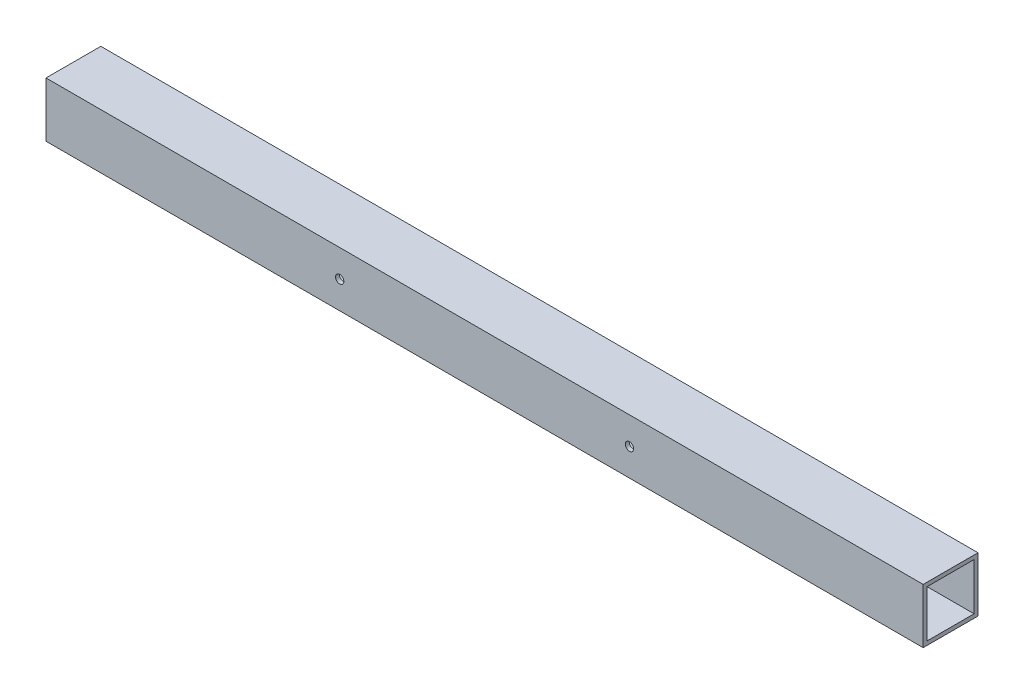
ISO-10303-21;
HEADER;
FILE_DESCRIPTION(('STEP AP214'),'2;1');
FILE_NAME('part.step','',(''),(''),'','','');
FILE_SCHEMA(('AUTOMOTIVE_DESIGN { 1 0 10303 214 1 1 1 1 }'));
ENDSEC;
DATA;
#1=APPLICATION_CONTEXT('core data for automotive mechanical design processes');
#2=APPLICATION_PROTOCOL_DEFINITION('international standard','automotive_design',2000,#1);
#3=PRODUCT_CONTEXT('',#1,'mechanical');
#4=PRODUCT('Part','Part','',(#3));
#5=PRODUCT_RELATED_PRODUCT_CATEGORY('part','',(#4));
#6=PRODUCT_DEFINITION_FORMATION('','',#4);
#7=PRODUCT_DEFINITION_CONTEXT('part definition',#1,'design');
#8=PRODUCT_DEFINITION('design','',#6,#7);
#9=PRODUCT_DEFINITION_SHAPE('','',#8);
#10=(LENGTH_UNIT() NAMED_UNIT(*) SI_UNIT(.MILLI.,.METRE.));
#11=(NAMED_UNIT(*) PLANE_ANGLE_UNIT() SI_UNIT($,.RADIAN.));
#12=(NAMED_UNIT(*) SI_UNIT($,.STERADIAN.) SOLID_ANGLE_UNIT());
#13=UNCERTAINTY_MEASURE_WITH_UNIT(LENGTH_MEASURE(1.E-05),#10,'distance_accuracy_value','');
#14=(GEOMETRIC_REPRESENTATION_CONTEXT(3) GLOBAL_UNCERTAINTY_ASSIGNED_CONTEXT((#13)) GLOBAL_UNIT_ASSIGNED_CONTEXT((#10,
#11,#12)) REPRESENTATION_CONTEXT('',''));
#15=CARTESIAN_POINT('',(0.,0.,0.));
#16=DIRECTION('',(0.,0.,1.));
#17=DIRECTION('',(1.,0.,0.));
#18=AXIS2_PLACEMENT_3D('',#15,#16,#17);
#19=CARTESIAN_POINT('',(-355.6,-22.2249999999999,-22.225));
#20=DIRECTION('',(0.,0.,-1.));
#21=DIRECTION('',(-1.,0.,0.));
#22=AXIS2_PLACEMENT_3D('',#19,#20,#21);
#23=PLANE('',#22);
#24=CARTESIAN_POINT('',(-117.475,0.,-22.225));
#25=DIRECTION('',(0.,0.,1.));
#26=DIRECTION('',(1.,0.,0.));
#27=AXIS2_PLACEMENT_3D('',#24,#25,#26);
#28=CIRCLE('',#27,3.37350099999999);
#29=CARTESIAN_POINT('',(-114.101499,0.,-22.225));
#30=VERTEX_POINT('',#29);
#31=EDGE_CURVE('E226',#30,#30,#28,.T.);
#32=ORIENTED_EDGE('',*,*,#31,.T.);
#33=EDGE_LOOP('',(#32));
#34=FACE_BOUND('',#33,.T.);
#35=CARTESIAN_POINT('',(117.475,0.,-22.225));
#36=DIRECTION('',(0.,0.,1.));
#37=DIRECTION('',(1.,0.,0.));
#38=AXIS2_PLACEMENT_3D('',#35,#36,#37);
#39=CIRCLE('',#38,3.37350099999999);
#40=CARTESIAN_POINT('',(120.848501,0.,-22.225));
#41=VERTEX_POINT('',#40);
#42=EDGE_CURVE('E205',#41,#41,#39,.T.);
#43=ORIENTED_EDGE('',*,*,#42,.T.);
#44=EDGE_LOOP('',(#43));
#45=FACE_BOUND('',#44,.T.);
#46=DIRECTION('',(1.,0.,0.));
#47=VECTOR('',#46,1.);
#48=CARTESIAN_POINT('',(-355.6,22.2249999999999,-22.225));
#49=LINE('',#48,#47);
#50=CARTESIAN_POINT('',(-355.6,22.2249999999999,-22.225));
#51=VERTEX_POINT('',#50);
#52=CARTESIAN_POINT('',(355.6,22.2249999999999,-22.225));
#53=VERTEX_POINT('',#52);
#54=EDGE_CURVE('E194',#51,#53,#49,.T.);
#55=ORIENTED_EDGE('',*,*,#54,.T.);
#56=DIRECTION('',(0.,1.,0.));
#57=VECTOR('',#56,1.);
#58=CARTESIAN_POINT('',(355.6,-22.2249999999999,-22.225));
#59=LINE('',#58,#57);
#60=CARTESIAN_POINT('',(355.6,-22.2249999999999,-22.225));
#61=VERTEX_POINT('',#60);
#62=EDGE_CURVE('E147',#61,#53,#59,.T.);
#63=ORIENTED_EDGE('',*,*,#62,.F.);
#64=DIRECTION('',(1.,0.,0.));
#65=VECTOR('',#64,1.);
#66=CARTESIAN_POINT('',(-355.6,-22.2249999999999,-22.225));
#67=LINE('',#66,#65);
#68=CARTESIAN_POINT('',(-355.6,-22.2249999999999,-22.225));
#69=VERTEX_POINT('',#68);
#70=EDGE_CURVE('E11',#69,#61,#67,.T.);
#71=ORIENTED_EDGE('',*,*,#70,.F.);
#72=DIRECTION('',(0.,1.,0.));
#73=VECTOR('',#72,1.);
#74=CARTESIAN_POINT('',(-355.6,-22.2249999999999,-22.225));
#75=LINE('',#74,#73);
#76=EDGE_CURVE('E175',#69,#51,#75,.T.);
#77=ORIENTED_EDGE('',*,*,#76,.T.);
#78=EDGE_LOOP('',(#55,#63,#71,#77));
#79=FACE_BOUND('',#78,.T.);
#80=ADVANCED_FACE('F43',(#34,#45,#79),#23,.T.);
#81=CARTESIAN_POINT('',(-355.6,-22.2249999999999,22.225));
#82=DIRECTION('',(0.,-1.,0.));
#83=DIRECTION('',(0.,0.,-1.));
#84=AXIS2_PLACEMENT_3D('',#81,#82,#83);
#85=PLANE('',#84);
#86=ORIENTED_EDGE('',*,*,#70,.T.);
#87=DIRECTION('',(0.,0.,-1.));
#88=VECTOR('',#87,1.);
#89=CARTESIAN_POINT('',(355.6,-22.2249999999999,22.225));
#90=LINE('',#89,#88);
#91=CARTESIAN_POINT('',(355.6,-22.2249999999999,22.225));
#92=VERTEX_POINT('',#91);
#93=EDGE_CURVE('E159',#92,#61,#90,.T.);
#94=ORIENTED_EDGE('',*,*,#93,.F.);
#95=DIRECTION('',(1.,0.,0.));
#96=VECTOR('',#95,1.);
#97=CARTESIAN_POINT('',(-355.6,-22.2249999999999,22.225));
#98=LINE('',#97,#96);
#99=CARTESIAN_POINT('',(-355.6,-22.2249999999999,22.225));
#100=VERTEX_POINT('',#99);
#101=EDGE_CURVE('E52',#100,#92,#98,.T.);
#102=ORIENTED_EDGE('',*,*,#101,.F.);
#103=DIRECTION('',(0.,0.,-1.));
#104=VECTOR('',#103,1.);
#105=CARTESIAN_POINT('',(-355.6,-22.2249999999999,22.225));
#106=LINE('',#105,#104);
#107=EDGE_CURVE('E191',#100,#69,#106,.T.);
#108=ORIENTED_EDGE('',*,*,#107,.T.);
#109=EDGE_LOOP('',(#86,#94,#102,#108));
#110=FACE_BOUND('',#109,.T.);
#111=ADVANCED_FACE('F243',(#110),#85,.T.);
#112=CARTESIAN_POINT('',(-355.6,-22.2249999999999,22.225));
#113=DIRECTION('',(0.,0.,1.));
#114=DIRECTION('',(1.,0.,0.));
#115=AXIS2_PLACEMENT_3D('',#112,#113,#114);
#116=PLANE('',#115);
#117=CARTESIAN_POINT('',(-117.475,0.,22.225));
#118=DIRECTION('',(0.,0.,1.));
#119=DIRECTION('',(1.,0.,0.));
#120=AXIS2_PLACEMENT_3D('',#117,#118,#119);
#121=CIRCLE('',#120,3.373501);
#122=CARTESIAN_POINT('',(-114.101499,0.,22.225));
#123=VERTEX_POINT('',#122);
#124=EDGE_CURVE('E230',#123,#123,#121,.T.);
#125=ORIENTED_EDGE('',*,*,#124,.F.);
#126=EDGE_LOOP('',(#125));
#127=FACE_BOUND('',#126,.T.);
#128=CARTESIAN_POINT('',(117.475,0.,22.225));
#129=DIRECTION('',(0.,0.,1.));
#130=DIRECTION('',(1.,0.,0.));
#131=AXIS2_PLACEMENT_3D('',#128,#129,#130);
#132=CIRCLE('',#131,3.373501);
#133=CARTESIAN_POINT('',(120.848501,0.,22.225));
#134=VERTEX_POINT('',#133);
#135=EDGE_CURVE('E213',#134,#134,#132,.T.);
#136=ORIENTED_EDGE('',*,*,#135,.F.);
#137=EDGE_LOOP('',(#136));
#138=FACE_BOUND('',#137,.T.);
#139=ORIENTED_EDGE('',*,*,#101,.T.);
#140=DIRECTION('',(0.,-1.,0.));
#141=VECTOR('',#140,1.);
#142=CARTESIAN_POINT('',(355.6,-22.2249999999999,22.225));
#143=LINE('',#142,#141);
#144=CARTESIAN_POINT('',(355.6,22.2249999999999,22.225));
#145=VERTEX_POINT('',#144);
#146=EDGE_CURVE('E155',#145,#92,#143,.T.);
#147=ORIENTED_EDGE('',*,*,#146,.F.);
#148=DIRECTION('',(1.,0.,0.));
#149=VECTOR('',#148,1.);
#150=CARTESIAN_POINT('',(-355.6,22.2249999999999,22.225));
#151=LINE('',#150,#149);
#152=CARTESIAN_POINT('',(-355.6,22.2249999999999,22.225));
#153=VERTEX_POINT('',#152);
#154=EDGE_CURVE('E198',#153,#145,#151,.T.);
#155=ORIENTED_EDGE('',*,*,#154,.F.);
#156=DIRECTION('',(0.,-1.,0.));
#157=VECTOR('',#156,1.);
#158=CARTESIAN_POINT('',(-355.6,-22.2249999999999,22.225));
#159=LINE('',#158,#157);
#160=EDGE_CURVE('E187',#153,#100,#159,.T.);
#161=ORIENTED_EDGE('',*,*,#160,.T.);
#162=EDGE_LOOP('',(#139,#147,#155,#161));
#163=FACE_BOUND('',#162,.T.);
#164=ADVANCED_FACE('F239',(#127,#138,#163),#116,.T.);
#165=CARTESIAN_POINT('',(-355.6,22.2249999999999,22.225));
#166=DIRECTION('',(0.,1.,0.));
#167=DIRECTION('',(0.,0.,1.));
#168=AXIS2_PLACEMENT_3D('',#165,#166,#167);
#169=PLANE('',#168);
#170=ORIENTED_EDGE('',*,*,#154,.T.);
#171=DIRECTION('',(0.,0.,1.));
#172=VECTOR('',#171,1.);
#173=CARTESIAN_POINT('',(355.6,22.2249999999999,22.225));
#174=LINE('',#173,#172);
#175=EDGE_CURVE('E151',#53,#145,#174,.T.);
#176=ORIENTED_EDGE('',*,*,#175,.F.);
#177=ORIENTED_EDGE('',*,*,#54,.F.);
#178=DIRECTION('',(0.,0.,1.));
#179=VECTOR('',#178,1.);
#180=CARTESIAN_POINT('',(-355.6,22.2249999999999,22.225));
#181=LINE('',#180,#179);
#182=EDGE_CURVE('E183',#51,#153,#181,.T.);
#183=ORIENTED_EDGE('',*,*,#182,.T.);
#184=EDGE_LOOP('',(#170,#176,#177,#183));
#185=FACE_BOUND('',#184,.T.);
#186=ADVANCED_FACE('F242',(#185),#169,.T.);
#187=CARTESIAN_POINT('',(-355.6,0.,0.));
#188=DIRECTION('',(-1.,0.,0.));
#189=DIRECTION('',(0.,0.,1.));
#190=AXIS2_PLACEMENT_3D('',#187,#188,#189);
#191=PLANE('',#190);
#192=DIRECTION('',(0.,1.,0.));
#193=VECTOR('',#192,1.);
#194=CARTESIAN_POINT('',(-355.6,-19.05,-19.05));
#195=LINE('',#194,#193);
#196=CARTESIAN_POINT('',(-355.6,-19.05,-19.05));
#197=VERTEX_POINT('',#196);
#198=CARTESIAN_POINT('',(-355.6,19.05,-19.05));
#199=VERTEX_POINT('',#198);
#200=EDGE_CURVE('E163',#197,#199,#195,.T.);
#201=ORIENTED_EDGE('',*,*,#200,.T.);
#202=DIRECTION('',(0.,0.,1.));
#203=VECTOR('',#202,1.);
#204=CARTESIAN_POINT('',(-355.6,19.05,19.05));
#205=LINE('',#204,#203);
#206=CARTESIAN_POINT('',(-355.6,19.05,19.05));
#207=VERTEX_POINT('',#206);
#208=EDGE_CURVE('E116',#199,#207,#205,.T.);
#209=ORIENTED_EDGE('',*,*,#208,.T.);
#210=DIRECTION('',(0.,-1.,0.));
#211=VECTOR('',#210,1.);
#212=CARTESIAN_POINT('',(-355.6,-19.05,19.05));
#213=LINE('',#212,#211);
#214=CARTESIAN_POINT('',(-355.6,-19.05,19.05));
#215=VERTEX_POINT('',#214);
#216=EDGE_CURVE('E60',#207,#215,#213,.T.);
#217=ORIENTED_EDGE('',*,*,#216,.T.);
#218=DIRECTION('',(0.,0.,-1.));
#219=VECTOR('',#218,1.);
#220=CARTESIAN_POINT('',(-355.6,-19.05,19.05));
#221=LINE('',#220,#219);
#222=EDGE_CURVE('E122',#215,#197,#221,.T.);
#223=ORIENTED_EDGE('',*,*,#222,.T.);
#224=EDGE_LOOP('',(#201,#209,#217,#223));
#225=FACE_BOUND('',#224,.T.);
#226=ORIENTED_EDGE('',*,*,#76,.F.);
#227=ORIENTED_EDGE('',*,*,#107,.F.);
#228=ORIENTED_EDGE('',*,*,#160,.F.);
#229=ORIENTED_EDGE('',*,*,#182,.F.);
#230=EDGE_LOOP('',(#226,#227,#228,#229));
#231=FACE_BOUND('',#230,.T.);
#232=ADVANCED_FACE('F255',(#225,#231),#191,.T.);
#233=CARTESIAN_POINT('',(-355.6,-19.05,-19.05));
#234=DIRECTION('',(0.,0.,-1.));
#235=DIRECTION('',(-1.,0.,0.));
#236=AXIS2_PLACEMENT_3D('',#233,#234,#235);
#237=PLANE('',#236);
#238=CARTESIAN_POINT('',(-117.475,0.,-19.05));
#239=DIRECTION('',(0.,0.,-1.));
#240=DIRECTION('',(-1.,0.,0.));
#241=AXIS2_PLACEMENT_3D('',#238,#239,#240);
#242=CIRCLE('',#241,3.37350099999999);
#243=CARTESIAN_POINT('',(-120.848501,0.,-19.05));
#244=VERTEX_POINT('',#243);
#245=EDGE_CURVE('E220',#244,#244,#242,.T.);
#246=ORIENTED_EDGE('',*,*,#245,.T.);
#247=EDGE_LOOP('',(#246));
#248=FACE_BOUND('',#247,.T.);
#249=CARTESIAN_POINT('',(117.475,0.,-19.05));
#250=DIRECTION('',(0.,0.,-1.));
#251=DIRECTION('',(-1.,0.,0.));
#252=AXIS2_PLACEMENT_3D('',#249,#250,#251);
#253=CIRCLE('',#252,3.37350099999999);
#254=CARTESIAN_POINT('',(114.101499,0.,-19.05));
#255=VERTEX_POINT('',#254);
#256=EDGE_CURVE('E202',#255,#255,#253,.T.);
#257=ORIENTED_EDGE('',*,*,#256,.T.);
#258=EDGE_LOOP('',(#257));
#259=FACE_BOUND('',#258,.T.);
#260=DIRECTION('',(1.,0.,0.));
#261=VECTOR('',#260,1.);
#262=CARTESIAN_POINT('',(-355.6,-19.05,-19.05));
#263=LINE('',#262,#261);
#264=CARTESIAN_POINT('',(355.6,-19.05,-19.05));
#265=VERTEX_POINT('',#264);
#266=EDGE_CURVE('E127',#197,#265,#263,.T.);
#267=ORIENTED_EDGE('',*,*,#266,.T.);
#268=DIRECTION('',(0.,1.,0.));
#269=VECTOR('',#268,1.);
#270=CARTESIAN_POINT('',(355.6,-19.05,-19.05));
#271=LINE('',#270,#269);
#272=CARTESIAN_POINT('',(355.6,19.05,-19.05));
#273=VERTEX_POINT('',#272);
#274=EDGE_CURVE('E125',#265,#273,#271,.T.);
#275=ORIENTED_EDGE('',*,*,#274,.T.);
#276=DIRECTION('',(1.,0.,0.));
#277=VECTOR('',#276,1.);
#278=CARTESIAN_POINT('',(-355.6,19.05,-19.05));
#279=LINE('',#278,#277);
#280=EDGE_CURVE('E109',#199,#273,#279,.T.);
#281=ORIENTED_EDGE('',*,*,#280,.F.);
#282=ORIENTED_EDGE('',*,*,#200,.F.);
#283=EDGE_LOOP('',(#267,#275,#281,#282));
#284=FACE_BOUND('',#283,.T.);
#285=ADVANCED_FACE('F126',(#248,#259,#284),#237,.F.);
#286=CARTESIAN_POINT('',(-355.6,-19.05,19.05));
#287=DIRECTION('',(0.,-1.,0.));
#288=DIRECTION('',(0.,0.,-1.));
#289=AXIS2_PLACEMENT_3D('',#286,#287,#288);
#290=PLANE('',#289);
#291=DIRECTION('',(1.,0.,0.));
#292=VECTOR('',#291,1.);
#293=CARTESIAN_POINT('',(-355.6,-19.05,19.05));
#294=LINE('',#293,#292);
#295=CARTESIAN_POINT('',(355.6,-19.05,19.05));
#296=VERTEX_POINT('',#295);
#297=EDGE_CURVE('E176',#215,#296,#294,.T.);
#298=ORIENTED_EDGE('',*,*,#297,.T.);
#299=DIRECTION('',(0.,0.,-1.));
#300=VECTOR('',#299,1.);
#301=CARTESIAN_POINT('',(355.6,-19.05,19.05));
#302=LINE('',#301,#300);
#303=EDGE_CURVE('E141',#296,#265,#302,.T.);
#304=ORIENTED_EDGE('',*,*,#303,.T.);
#305=ORIENTED_EDGE('',*,*,#266,.F.);
#306=ORIENTED_EDGE('',*,*,#222,.F.);
#307=EDGE_LOOP('',(#298,#304,#305,#306));
#308=FACE_BOUND('',#307,.T.);
#309=ADVANCED_FACE('F279',(#308),#290,.F.);
#310=CARTESIAN_POINT('',(-355.6,-19.05,19.05));
#311=DIRECTION('',(0.,0.,1.));
#312=DIRECTION('',(1.,0.,0.));
#313=AXIS2_PLACEMENT_3D('',#310,#311,#312);
#314=PLANE('',#313);
#315=CARTESIAN_POINT('',(-117.475,0.,19.05));
#316=DIRECTION('',(0.,0.,1.));
#317=DIRECTION('',(1.,0.,0.));
#318=AXIS2_PLACEMENT_3D('',#315,#316,#317);
#319=CIRCLE('',#318,3.37350099999999);
#320=CARTESIAN_POINT('',(-114.101499,0.,19.05));
#321=VERTEX_POINT('',#320);
#322=EDGE_CURVE('E46',#321,#321,#319,.T.);
#323=ORIENTED_EDGE('',*,*,#322,.T.);
#324=EDGE_LOOP('',(#323));
#325=FACE_BOUND('',#324,.T.);
#326=CARTESIAN_POINT('',(117.475,0.,19.05));
#327=DIRECTION('',(0.,0.,1.));
#328=DIRECTION('',(1.,0.,0.));
#329=AXIS2_PLACEMENT_3D('',#326,#327,#328);
#330=CIRCLE('',#329,3.37350099999999);
#331=CARTESIAN_POINT('',(120.848501,0.,19.05));
#332=VERTEX_POINT('',#331);
#333=EDGE_CURVE('E132',#332,#332,#330,.T.);
#334=ORIENTED_EDGE('',*,*,#333,.T.);
#335=EDGE_LOOP('',(#334));
#336=FACE_BOUND('',#335,.T.);
#337=DIRECTION('',(1.,0.,0.));
#338=VECTOR('',#337,1.);
#339=CARTESIAN_POINT('',(-355.6,19.05,19.05));
#340=LINE('',#339,#338);
#341=CARTESIAN_POINT('',(355.6,19.05,19.05));
#342=VERTEX_POINT('',#341);
#343=EDGE_CURVE('E121',#207,#342,#340,.T.);
#344=ORIENTED_EDGE('',*,*,#343,.T.);
#345=DIRECTION('',(0.,-1.,0.));
#346=VECTOR('',#345,1.);
#347=CARTESIAN_POINT('',(355.6,-19.05,19.05));
#348=LINE('',#347,#346);
#349=EDGE_CURVE('E136',#342,#296,#348,.T.);
#350=ORIENTED_EDGE('',*,*,#349,.T.);
#351=ORIENTED_EDGE('',*,*,#297,.F.);
#352=ORIENTED_EDGE('',*,*,#216,.F.);
#353=EDGE_LOOP('',(#344,#350,#351,#352));
#354=FACE_BOUND('',#353,.T.);
#355=ADVANCED_FACE('F284',(#325,#336,#354),#314,.F.);
#356=CARTESIAN_POINT('',(-355.6,19.05,19.05));
#357=DIRECTION('',(0.,1.,0.));
#358=DIRECTION('',(0.,0.,1.));
#359=AXIS2_PLACEMENT_3D('',#356,#357,#358);
#360=PLANE('',#359);
#361=ORIENTED_EDGE('',*,*,#280,.T.);
#362=DIRECTION('',(0.,0.,1.));
#363=VECTOR('',#362,1.);
#364=CARTESIAN_POINT('',(355.6,19.05,19.05));
#365=LINE('',#364,#363);
#366=EDGE_CURVE('E113',#273,#342,#365,.T.);
#367=ORIENTED_EDGE('',*,*,#366,.T.);
#368=ORIENTED_EDGE('',*,*,#343,.F.);
#369=ORIENTED_EDGE('',*,*,#208,.F.);
#370=EDGE_LOOP('',(#361,#367,#368,#369));
#371=FACE_BOUND('',#370,.T.);
#372=ADVANCED_FACE('F111',(#371),#360,.F.);
#373=CARTESIAN_POINT('',(355.6,0.,0.));
#374=DIRECTION('',(-1.,0.,0.));
#375=DIRECTION('',(0.,0.,1.));
#376=AXIS2_PLACEMENT_3D('',#373,#374,#375);
#377=PLANE('',#376);
#378=ORIENTED_EDGE('',*,*,#62,.T.);
#379=ORIENTED_EDGE('',*,*,#175,.T.);
#380=ORIENTED_EDGE('',*,*,#146,.T.);
#381=ORIENTED_EDGE('',*,*,#93,.T.);
#382=EDGE_LOOP('',(#378,#379,#380,#381));
#383=FACE_BOUND('',#382,.T.);
#384=ORIENTED_EDGE('',*,*,#274,.F.);
#385=ORIENTED_EDGE('',*,*,#303,.F.);
#386=ORIENTED_EDGE('',*,*,#349,.F.);
#387=ORIENTED_EDGE('',*,*,#366,.F.);
#388=EDGE_LOOP('',(#384,#385,#386,#387));
#389=FACE_BOUND('',#388,.T.);
#390=ADVANCED_FACE('F134',(#383,#389),#377,.F.);
#391=CARTESIAN_POINT('',(117.475,0.,22.225));
#392=DIRECTION('',(0.,0.,1.));
#393=DIRECTION('',(1.,0.,0.));
#394=AXIS2_PLACEMENT_3D('',#391,#392,#393);
#395=CYLINDRICAL_SURFACE('',#394,3.37350099999999);
#396=ORIENTED_EDGE('',*,*,#42,.F.);
#397=EDGE_LOOP('',(#396));
#398=FACE_BOUND('',#397,.T.);
#399=ORIENTED_EDGE('',*,*,#256,.F.);
#400=EDGE_LOOP('',(#399));
#401=FACE_BOUND('',#400,.T.);
#402=ADVANCED_FACE('F295',(#398,#401),#395,.F.);
#403=ORIENTED_EDGE('',*,*,#135,.T.);
#404=EDGE_LOOP('',(#403));
#405=FACE_BOUND('',#404,.T.);
#406=ORIENTED_EDGE('',*,*,#333,.F.);
#407=EDGE_LOOP('',(#406));
#408=FACE_BOUND('',#407,.T.);
#409=ADVANCED_FACE('F296',(#405,#408),#395,.F.);
#410=CARTESIAN_POINT('',(-117.475,0.,22.225));
#411=DIRECTION('',(0.,0.,1.));
#412=DIRECTION('',(1.,0.,0.));
#413=AXIS2_PLACEMENT_3D('',#410,#411,#412);
#414=CYLINDRICAL_SURFACE('',#413,3.37350099999999);
#415=ORIENTED_EDGE('',*,*,#124,.T.);
#416=EDGE_LOOP('',(#415));
#417=FACE_BOUND('',#416,.T.);
#418=ORIENTED_EDGE('',*,*,#322,.F.);
#419=EDGE_LOOP('',(#418));
#420=FACE_BOUND('',#419,.T.);
#421=ADVANCED_FACE('F236',(#417,#420),#414,.F.);
#422=ORIENTED_EDGE('',*,*,#31,.F.);
#423=EDGE_LOOP('',(#422));
#424=FACE_BOUND('',#423,.T.);
#425=ORIENTED_EDGE('',*,*,#245,.F.);
#426=EDGE_LOOP('',(#425));
#427=FACE_BOUND('',#426,.T.);
#428=ADVANCED_FACE('F272',(#424,#427),#414,.F.);
#429=CLOSED_SHELL('',(#80,#111,#164,#186,#232,#285,#309,#355,#372,#390,#402,#409,#421,#428));
#430=MANIFOLD_SOLID_BREP('B2',#429);
#431=ADVANCED_BREP_SHAPE_REPRESENTATION('',(#18,#430),#14);
#432=SHAPE_DEFINITION_REPRESENTATION(#9,#431);
ENDSEC;
END-ISO-10303-21;
